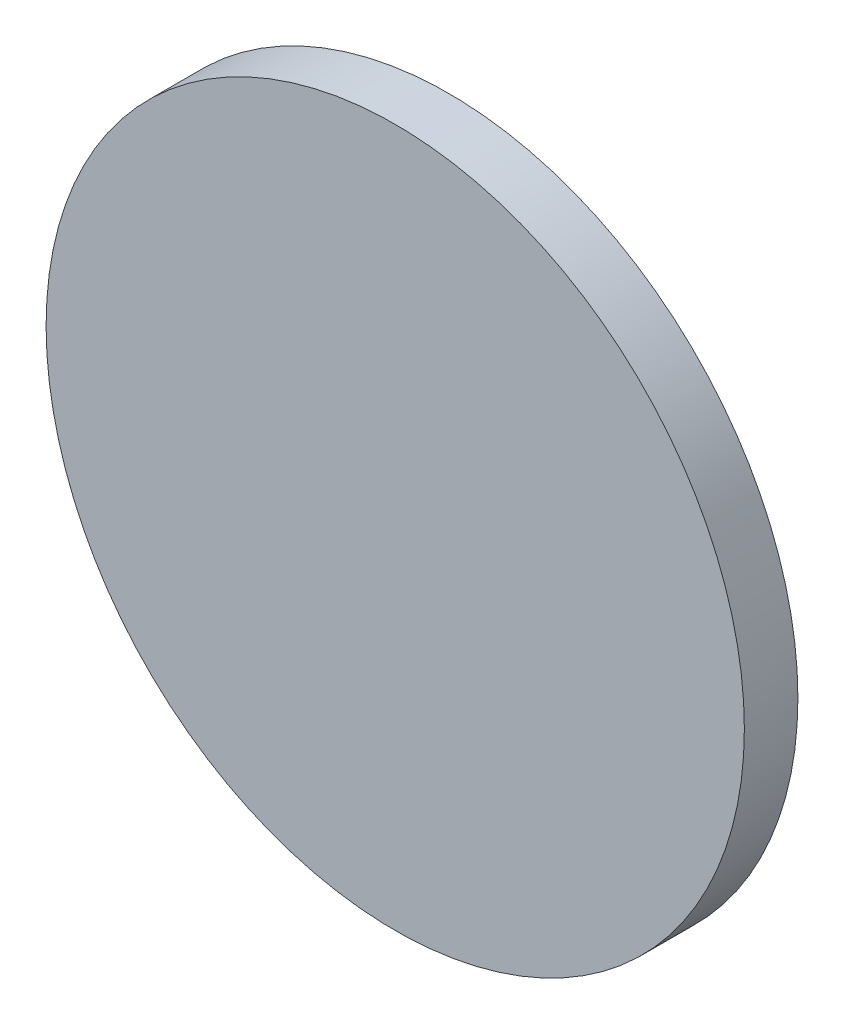
ISO-10303-21;
HEADER;
FILE_DESCRIPTION(('STEP AP214'),'2;1');
FILE_NAME('part.step','',(''),(''),'','','');
FILE_SCHEMA(('AUTOMOTIVE_DESIGN { 1 0 10303 214 1 1 1 1 }'));
ENDSEC;
DATA;
#1=APPLICATION_CONTEXT('core data for automotive mechanical design processes');
#2=APPLICATION_PROTOCOL_DEFINITION('international standard','automotive_design',2000,#1);
#3=PRODUCT_CONTEXT('',#1,'mechanical');
#4=PRODUCT('Part','Part','',(#3));
#5=PRODUCT_RELATED_PRODUCT_CATEGORY('part','',(#4));
#6=PRODUCT_DEFINITION_FORMATION('','',#4);
#7=PRODUCT_DEFINITION_CONTEXT('part definition',#1,'design');
#8=PRODUCT_DEFINITION('design','',#6,#7);
#9=PRODUCT_DEFINITION_SHAPE('','',#8);
#10=(LENGTH_UNIT() NAMED_UNIT(*) SI_UNIT(.MILLI.,.METRE.));
#11=(NAMED_UNIT(*) PLANE_ANGLE_UNIT() SI_UNIT($,.RADIAN.));
#12=(NAMED_UNIT(*) SI_UNIT($,.STERADIAN.) SOLID_ANGLE_UNIT());
#13=UNCERTAINTY_MEASURE_WITH_UNIT(LENGTH_MEASURE(1.E-05),#10,'distance_accuracy_value','');
#14=(GEOMETRIC_REPRESENTATION_CONTEXT(3) GLOBAL_UNCERTAINTY_ASSIGNED_CONTEXT((#13)) GLOBAL_UNIT_ASSIGNED_CONTEXT((#10,
#11,#12)) REPRESENTATION_CONTEXT('',''));
#15=CARTESIAN_POINT('',(0.,0.,0.));
#16=DIRECTION('',(0.,0.,1.));
#17=DIRECTION('',(1.,0.,0.));
#18=AXIS2_PLACEMENT_3D('',#15,#16,#17);
#19=CARTESIAN_POINT('',(108.614983942284,61.5632418345266,2.3));
#20=DIRECTION('',(0.,0.,-1.));
#21=DIRECTION('',(-1.,0.,0.));
#22=AXIS2_PLACEMENT_3D('',#19,#20,#21);
#23=CYLINDRICAL_SURFACE('',#22,15.);
#24=CARTESIAN_POINT('',(108.614983942284,61.5632418345266,2.3));
#25=DIRECTION('',(0.,0.,1.));
#26=DIRECTION('',(1.,0.,0.));
#27=AXIS2_PLACEMENT_3D('',#24,#25,#26);
#28=CIRCLE('',#27,15.);
#29=CARTESIAN_POINT('',(123.614983942284,61.5632418345266,2.3));
#30=VERTEX_POINT('',#29);
#31=EDGE_CURVE('E10',#30,#30,#28,.T.);
#32=ORIENTED_EDGE('',*,*,#31,.F.);
#33=EDGE_LOOP('',(#32));
#34=FACE_BOUND('',#33,.T.);
#35=CARTESIAN_POINT('',(108.614983942284,61.5632418345266,0.));
#36=DIRECTION('',(0.,0.,1.));
#37=DIRECTION('',(1.,0.,0.));
#38=AXIS2_PLACEMENT_3D('',#35,#36,#37);
#39=CIRCLE('',#38,15.);
#40=CARTESIAN_POINT('',(123.614983942284,61.5632418345266,0.));
#41=VERTEX_POINT('',#40);
#42=EDGE_CURVE('E38',#41,#41,#39,.T.);
#43=ORIENTED_EDGE('',*,*,#42,.T.);
#44=EDGE_LOOP('',(#43));
#45=FACE_BOUND('',#44,.T.);
#46=ADVANCED_FACE('F35',(#34,#45),#23,.T.);
#47=CARTESIAN_POINT('',(108.614983942284,61.5632418345266,2.3));
#48=DIRECTION('',(0.,0.,1.));
#49=DIRECTION('',(1.,0.,0.));
#50=AXIS2_PLACEMENT_3D('',#47,#48,#49);
#51=PLANE('',#50);
#52=ORIENTED_EDGE('',*,*,#31,.T.);
#53=EDGE_LOOP('',(#52));
#54=FACE_BOUND('',#53,.T.);
#55=ADVANCED_FACE('F50',(#54),#51,.T.);
#56=CARTESIAN_POINT('',(108.614983942284,61.5632418345266,0.));
#57=DIRECTION('',(0.,0.,1.));
#58=DIRECTION('',(1.,0.,0.));
#59=AXIS2_PLACEMENT_3D('',#56,#57,#58);
#60=PLANE('',#59);
#61=ORIENTED_EDGE('',*,*,#42,.F.);
#62=EDGE_LOOP('',(#61));
#63=FACE_BOUND('',#62,.T.);
#64=ADVANCED_FACE('F48',(#63),#60,.F.);
#65=CLOSED_SHELL('',(#46,#55,#64));
#66=MANIFOLD_SOLID_BREP('B2',#65);
#67=ADVANCED_BREP_SHAPE_REPRESENTATION('',(#18,#66),#14);
#68=SHAPE_DEFINITION_REPRESENTATION(#9,#67);
ENDSEC;
END-ISO-10303-21;
